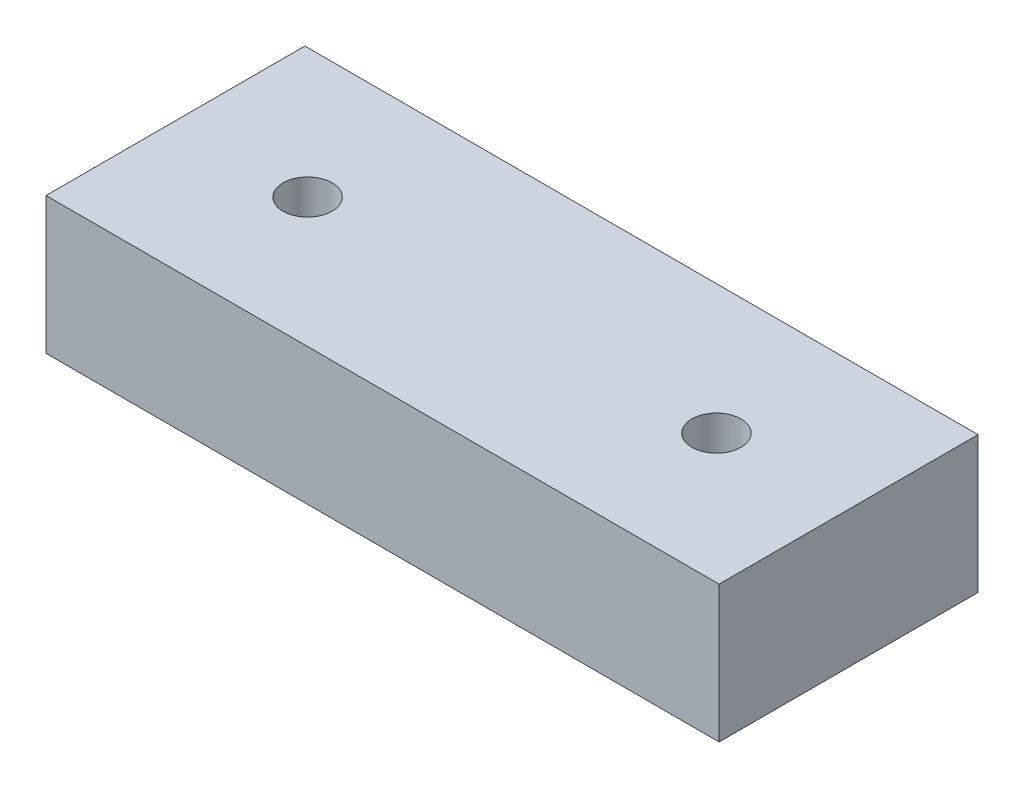
ISO-10303-21;
HEADER;
FILE_DESCRIPTION(('STEP AP214'),'2;1');
FILE_NAME('part.step','',(''),(''),'','','');
FILE_SCHEMA(('AUTOMOTIVE_DESIGN { 1 0 10303 214 1 1 1 1 }'));
ENDSEC;
DATA;
#1=APPLICATION_CONTEXT('core data for automotive mechanical design processes');
#2=APPLICATION_PROTOCOL_DEFINITION('international standard','automotive_design',2000,#1);
#3=PRODUCT_CONTEXT('',#1,'mechanical');
#4=PRODUCT('Part','Part','',(#3));
#5=PRODUCT_RELATED_PRODUCT_CATEGORY('part','',(#4));
#6=PRODUCT_DEFINITION_FORMATION('','',#4);
#7=PRODUCT_DEFINITION_CONTEXT('part definition',#1,'design');
#8=PRODUCT_DEFINITION('design','',#6,#7);
#9=PRODUCT_DEFINITION_SHAPE('','',#8);
#10=(LENGTH_UNIT() NAMED_UNIT(*) SI_UNIT(.MILLI.,.METRE.));
#11=(NAMED_UNIT(*) PLANE_ANGLE_UNIT() SI_UNIT($,.RADIAN.));
#12=(NAMED_UNIT(*) SI_UNIT($,.STERADIAN.) SOLID_ANGLE_UNIT());
#13=UNCERTAINTY_MEASURE_WITH_UNIT(LENGTH_MEASURE(1.E-05),#10,'distance_accuracy_value','');
#14=(GEOMETRIC_REPRESENTATION_CONTEXT(3) GLOBAL_UNCERTAINTY_ASSIGNED_CONTEXT((#13)) GLOBAL_UNIT_ASSIGNED_CONTEXT((#10,
#11,#12)) REPRESENTATION_CONTEXT('',''));
#15=CARTESIAN_POINT('',(0.,0.,0.));
#16=DIRECTION('',(0.,0.,1.));
#17=DIRECTION('',(1.,0.,0.));
#18=AXIS2_PLACEMENT_3D('',#15,#16,#17);
#19=CARTESIAN_POINT('',(-15.478125,6.2865,5.953125));
#20=DIRECTION('',(1.,0.,0.));
#21=DIRECTION('',(0.,0.,-1.));
#22=AXIS2_PLACEMENT_3D('',#19,#20,#21);
#23=PLANE('',#22);
#24=DIRECTION('',(0.,0.,1.));
#25=VECTOR('',#24,1.);
#26=CARTESIAN_POINT('',(-15.478125,0.,5.953125));
#27=LINE('',#26,#25);
#28=CARTESIAN_POINT('',(-15.478125,0.,-5.953125));
#29=VERTEX_POINT('',#28);
#30=CARTESIAN_POINT('',(-15.478125,0.,5.953125));
#31=VERTEX_POINT('',#30);
#32=EDGE_CURVE('E102',#29,#31,#27,.T.);
#33=ORIENTED_EDGE('',*,*,#32,.T.);
#34=DIRECTION('',(0.,-1.,0.));
#35=VECTOR('',#34,1.);
#36=CARTESIAN_POINT('',(-15.478125,6.2865,5.953125));
#37=LINE('',#36,#35);
#38=CARTESIAN_POINT('',(-15.478125,6.2865,5.953125));
#39=VERTEX_POINT('',#38);
#40=EDGE_CURVE('E11',#39,#31,#37,.T.);
#41=ORIENTED_EDGE('',*,*,#40,.F.);
#42=DIRECTION('',(0.,0.,1.));
#43=VECTOR('',#42,1.);
#44=CARTESIAN_POINT('',(-15.478125,6.2865,5.953125));
#45=LINE('',#44,#43);
#46=CARTESIAN_POINT('',(-15.478125,6.2865,-5.953125));
#47=VERTEX_POINT('',#46);
#48=EDGE_CURVE('E89',#47,#39,#45,.T.);
#49=ORIENTED_EDGE('',*,*,#48,.F.);
#50=DIRECTION('',(0.,-1.,0.));
#51=VECTOR('',#50,1.);
#52=CARTESIAN_POINT('',(-15.478125,6.2865,-5.953125));
#53=LINE('',#52,#51);
#54=EDGE_CURVE('E98',#47,#29,#53,.T.);
#55=ORIENTED_EDGE('',*,*,#54,.T.);
#56=EDGE_LOOP('',(#33,#41,#49,#55));
#57=FACE_BOUND('',#56,.T.);
#58=ADVANCED_FACE('F36',(#57),#23,.F.);
#59=CARTESIAN_POINT('',(15.478125,6.2865,5.95312499999999));
#60=DIRECTION('',(0.,0.,-1.));
#61=DIRECTION('',(-1.,0.,0.));
#62=AXIS2_PLACEMENT_3D('',#59,#60,#61);
#63=PLANE('',#62);
#64=DIRECTION('',(1.,0.,0.));
#65=VECTOR('',#64,1.);
#66=CARTESIAN_POINT('',(15.478125,0.,5.95312499999999));
#67=LINE('',#66,#65);
#68=CARTESIAN_POINT('',(15.478125,0.,5.95312499999999));
#69=VERTEX_POINT('',#68);
#70=EDGE_CURVE('E93',#31,#69,#67,.T.);
#71=ORIENTED_EDGE('',*,*,#70,.T.);
#72=DIRECTION('',(0.,-1.,0.));
#73=VECTOR('',#72,1.);
#74=CARTESIAN_POINT('',(15.478125,6.2865,5.95312499999999));
#75=LINE('',#74,#73);
#76=CARTESIAN_POINT('',(15.478125,6.2865,5.95312499999999));
#77=VERTEX_POINT('',#76);
#78=EDGE_CURVE('E45',#77,#69,#75,.T.);
#79=ORIENTED_EDGE('',*,*,#78,.F.);
#80=DIRECTION('',(1.,0.,0.));
#81=VECTOR('',#80,1.);
#82=CARTESIAN_POINT('',(15.478125,6.2865,5.95312499999999));
#83=LINE('',#82,#81);
#84=EDGE_CURVE('E84',#39,#77,#83,.T.);
#85=ORIENTED_EDGE('',*,*,#84,.F.);
#86=ORIENTED_EDGE('',*,*,#40,.T.);
#87=EDGE_LOOP('',(#71,#79,#85,#86));
#88=FACE_BOUND('',#87,.T.);
#89=ADVANCED_FACE('F92',(#88),#63,.F.);
#90=CARTESIAN_POINT('',(15.478125,6.2865,5.95312499999999));
#91=DIRECTION('',(-1.,0.,0.));
#92=DIRECTION('',(0.,0.,1.));
#93=AXIS2_PLACEMENT_3D('',#90,#91,#92);
#94=PLANE('',#93);
#95=DIRECTION('',(0.,0.,-1.));
#96=VECTOR('',#95,1.);
#97=CARTESIAN_POINT('',(15.478125,0.,5.95312499999999));
#98=LINE('',#97,#96);
#99=CARTESIAN_POINT('',(15.478125,0.,-5.953125));
#100=VERTEX_POINT('',#99);
#101=EDGE_CURVE('E71',#69,#100,#98,.T.);
#102=ORIENTED_EDGE('',*,*,#101,.T.);
#103=DIRECTION('',(0.,-1.,0.));
#104=VECTOR('',#103,1.);
#105=CARTESIAN_POINT('',(15.478125,6.2865,-5.953125));
#106=LINE('',#105,#104);
#107=CARTESIAN_POINT('',(15.478125,6.2865,-5.953125));
#108=VERTEX_POINT('',#107);
#109=EDGE_CURVE('E94',#108,#100,#106,.T.);
#110=ORIENTED_EDGE('',*,*,#109,.F.);
#111=DIRECTION('',(0.,0.,-1.));
#112=VECTOR('',#111,1.);
#113=CARTESIAN_POINT('',(15.478125,6.2865,5.95312499999999));
#114=LINE('',#113,#112);
#115=EDGE_CURVE('E87',#77,#108,#114,.T.);
#116=ORIENTED_EDGE('',*,*,#115,.F.);
#117=ORIENTED_EDGE('',*,*,#78,.T.);
#118=EDGE_LOOP('',(#102,#110,#116,#117));
#119=FACE_BOUND('',#118,.T.);
#120=ADVANCED_FACE('F96',(#119),#94,.F.);
#121=CARTESIAN_POINT('',(15.478125,6.2865,-5.953125));
#122=DIRECTION('',(0.,0.,1.));
#123=DIRECTION('',(1.,0.,0.));
#124=AXIS2_PLACEMENT_3D('',#121,#122,#123);
#125=PLANE('',#124);
#126=DIRECTION('',(-1.,0.,0.));
#127=VECTOR('',#126,1.);
#128=CARTESIAN_POINT('',(15.478125,0.,-5.953125));
#129=LINE('',#128,#127);
#130=EDGE_CURVE('E77',#100,#29,#129,.T.);
#131=ORIENTED_EDGE('',*,*,#130,.T.);
#132=ORIENTED_EDGE('',*,*,#54,.F.);
#133=DIRECTION('',(-1.,0.,0.));
#134=VECTOR('',#133,1.);
#135=CARTESIAN_POINT('',(15.478125,6.2865,-5.953125));
#136=LINE('',#135,#134);
#137=EDGE_CURVE('E54',#108,#47,#136,.T.);
#138=ORIENTED_EDGE('',*,*,#137,.F.);
#139=ORIENTED_EDGE('',*,*,#109,.T.);
#140=EDGE_LOOP('',(#131,#132,#138,#139));
#141=FACE_BOUND('',#140,.T.);
#142=ADVANCED_FACE('F144',(#141),#125,.F.);
#143=CARTESIAN_POINT('',(-15.478125,6.2865,-5.953125));
#144=DIRECTION('',(0.,1.,0.));
#145=DIRECTION('',(0.,0.,1.));
#146=AXIS2_PLACEMENT_3D('',#143,#144,#145);
#147=PLANE('',#146);
#148=CARTESIAN_POINT('',(-9.4020222441884,6.2865,0.));
#149=DIRECTION('',(0.,1.,0.));
#150=DIRECTION('',(0.,0.,1.));
#151=AXIS2_PLACEMENT_3D('',#148,#149,#150);
#152=CIRCLE('',#151,1.13029999999999);
#153=CARTESIAN_POINT('',(-9.4020222441884,6.2865,1.13029999999999));
#154=VERTEX_POINT('',#153);
#155=EDGE_CURVE('E123',#154,#154,#152,.T.);
#156=ORIENTED_EDGE('',*,*,#155,.F.);
#157=EDGE_LOOP('',(#156));
#158=FACE_BOUND('',#157,.T.);
#159=CARTESIAN_POINT('',(9.4020222441884,6.2865,0.));
#160=DIRECTION('',(0.,1.,0.));
#161=DIRECTION('',(0.,0.,1.));
#162=AXIS2_PLACEMENT_3D('',#159,#160,#161);
#163=CIRCLE('',#162,1.13029999999999);
#164=CARTESIAN_POINT('',(9.4020222441884,6.2865,1.13029999999999));
#165=VERTEX_POINT('',#164);
#166=EDGE_CURVE('E113',#165,#165,#163,.T.);
#167=ORIENTED_EDGE('',*,*,#166,.F.);
#168=EDGE_LOOP('',(#167));
#169=FACE_BOUND('',#168,.T.);
#170=ORIENTED_EDGE('',*,*,#48,.T.);
#171=ORIENTED_EDGE('',*,*,#84,.T.);
#172=ORIENTED_EDGE('',*,*,#115,.T.);
#173=ORIENTED_EDGE('',*,*,#137,.T.);
#174=EDGE_LOOP('',(#170,#171,#172,#173));
#175=FACE_BOUND('',#174,.T.);
#176=ADVANCED_FACE('F85',(#158,#169,#175),#147,.T.);
#177=CARTESIAN_POINT('',(-15.478125,0.,-5.953125));
#178=DIRECTION('',(0.,1.,0.));
#179=DIRECTION('',(0.,0.,1.));
#180=AXIS2_PLACEMENT_3D('',#177,#178,#179);
#181=PLANE('',#180);
#182=CARTESIAN_POINT('',(-9.4020222441884,0.,0.));
#183=DIRECTION('',(0.,1.,0.));
#184=DIRECTION('',(0.,0.,1.));
#185=AXIS2_PLACEMENT_3D('',#182,#183,#184);
#186=CIRCLE('',#185,1.13029999999999);
#187=CARTESIAN_POINT('',(-9.4020222441884,0.,1.13029999999999));
#188=VERTEX_POINT('',#187);
#189=EDGE_CURVE('E39',#188,#188,#186,.T.);
#190=ORIENTED_EDGE('',*,*,#189,.T.);
#191=EDGE_LOOP('',(#190));
#192=FACE_BOUND('',#191,.T.);
#193=CARTESIAN_POINT('',(9.4020222441884,0.,0.));
#194=DIRECTION('',(0.,1.,0.));
#195=DIRECTION('',(0.,0.,1.));
#196=AXIS2_PLACEMENT_3D('',#193,#194,#195);
#197=CIRCLE('',#196,1.13029999999999);
#198=CARTESIAN_POINT('',(9.4020222441884,0.,1.13029999999999));
#199=VERTEX_POINT('',#198);
#200=EDGE_CURVE('E110',#199,#199,#197,.T.);
#201=ORIENTED_EDGE('',*,*,#200,.T.);
#202=EDGE_LOOP('',(#201));
#203=FACE_BOUND('',#202,.T.);
#204=CARTESIAN_POINT('',(0.,0.,0.));
#205=DIRECTION('',(0.,-1.,0.));
#206=DIRECTION('',(0.,0.,-1.));
#207=AXIS2_PLACEMENT_3D('',#204,#205,#206);
#208=CIRCLE('',#207,2.38125);
#209=CARTESIAN_POINT('',(0.,0.,-2.38125));
#210=VERTEX_POINT('',#209);
#211=EDGE_CURVE('E112',#210,#210,#208,.T.);
#212=ORIENTED_EDGE('',*,*,#211,.F.);
#213=EDGE_LOOP('',(#212));
#214=FACE_BOUND('',#213,.T.);
#215=ORIENTED_EDGE('',*,*,#32,.F.);
#216=ORIENTED_EDGE('',*,*,#130,.F.);
#217=ORIENTED_EDGE('',*,*,#101,.F.);
#218=ORIENTED_EDGE('',*,*,#70,.F.);
#219=EDGE_LOOP('',(#215,#216,#217,#218));
#220=FACE_BOUND('',#219,.T.);
#221=ADVANCED_FACE('F134',(#192,#203,#214,#220),#181,.F.);
#222=CARTESIAN_POINT('',(0.,4.7625,0.));
#223=DIRECTION('',(0.,-1.,0.));
#224=DIRECTION('',(0.,0.,-1.));
#225=AXIS2_PLACEMENT_3D('',#222,#223,#224);
#226=CYLINDRICAL_SURFACE('',#225,2.38125);
#227=CARTESIAN_POINT('',(0.,4.7625,0.));
#228=DIRECTION('',(0.,-1.,0.));
#229=DIRECTION('',(0.,0.,-1.));
#230=AXIS2_PLACEMENT_3D('',#227,#228,#229);
#231=CIRCLE('',#230,2.38125);
#232=CARTESIAN_POINT('',(0.,4.7625,-2.38125));
#233=VERTEX_POINT('',#232);
#234=EDGE_CURVE('E105',#233,#233,#231,.T.);
#235=ORIENTED_EDGE('',*,*,#234,.F.);
#236=EDGE_LOOP('',(#235));
#237=FACE_BOUND('',#236,.T.);
#238=ORIENTED_EDGE('',*,*,#211,.T.);
#239=EDGE_LOOP('',(#238));
#240=FACE_BOUND('',#239,.T.);
#241=ADVANCED_FACE('F131',(#237,#240),#226,.F.);
#242=CARTESIAN_POINT('',(0.,4.7625,0.));
#243=DIRECTION('',(0.,-1.,0.));
#244=DIRECTION('',(0.,0.,-1.));
#245=AXIS2_PLACEMENT_3D('',#242,#243,#244);
#246=PLANE('',#245);
#247=ORIENTED_EDGE('',*,*,#234,.T.);
#248=EDGE_LOOP('',(#247));
#249=FACE_BOUND('',#248,.T.);
#250=ADVANCED_FACE('F129',(#249),#246,.T.);
#251=CARTESIAN_POINT('',(9.4020222441884,6.2865,0.));
#252=DIRECTION('',(0.,1.,0.));
#253=DIRECTION('',(0.,0.,1.));
#254=AXIS2_PLACEMENT_3D('',#251,#252,#253);
#255=CYLINDRICAL_SURFACE('',#254,1.13029999999999);
#256=ORIENTED_EDGE('',*,*,#166,.T.);
#257=EDGE_LOOP('',(#256));
#258=FACE_BOUND('',#257,.T.);
#259=ORIENTED_EDGE('',*,*,#200,.F.);
#260=EDGE_LOOP('',(#259));
#261=FACE_BOUND('',#260,.T.);
#262=ADVANCED_FACE('F185',(#258,#261),#255,.F.);
#263=CARTESIAN_POINT('',(-9.4020222441884,6.2865,0.));
#264=DIRECTION('',(0.,1.,0.));
#265=DIRECTION('',(0.,0.,1.));
#266=AXIS2_PLACEMENT_3D('',#263,#264,#265);
#267=CYLINDRICAL_SURFACE('',#266,1.13029999999999);
#268=ORIENTED_EDGE('',*,*,#155,.T.);
#269=EDGE_LOOP('',(#268));
#270=FACE_BOUND('',#269,.T.);
#271=ORIENTED_EDGE('',*,*,#189,.F.);
#272=EDGE_LOOP('',(#271));
#273=FACE_BOUND('',#272,.T.);
#274=ADVANCED_FACE('F205',(#270,#273),#267,.F.);
#275=CLOSED_SHELL('',(#58,#89,#120,#142,#176,#221,#241,#250,#262,#274));
#276=MANIFOLD_SOLID_BREP('B2',#275);
#277=ADVANCED_BREP_SHAPE_REPRESENTATION('',(#18,#276),#14);
#278=SHAPE_DEFINITION_REPRESENTATION(#9,#277);
ENDSEC;
END-ISO-10303-21;
